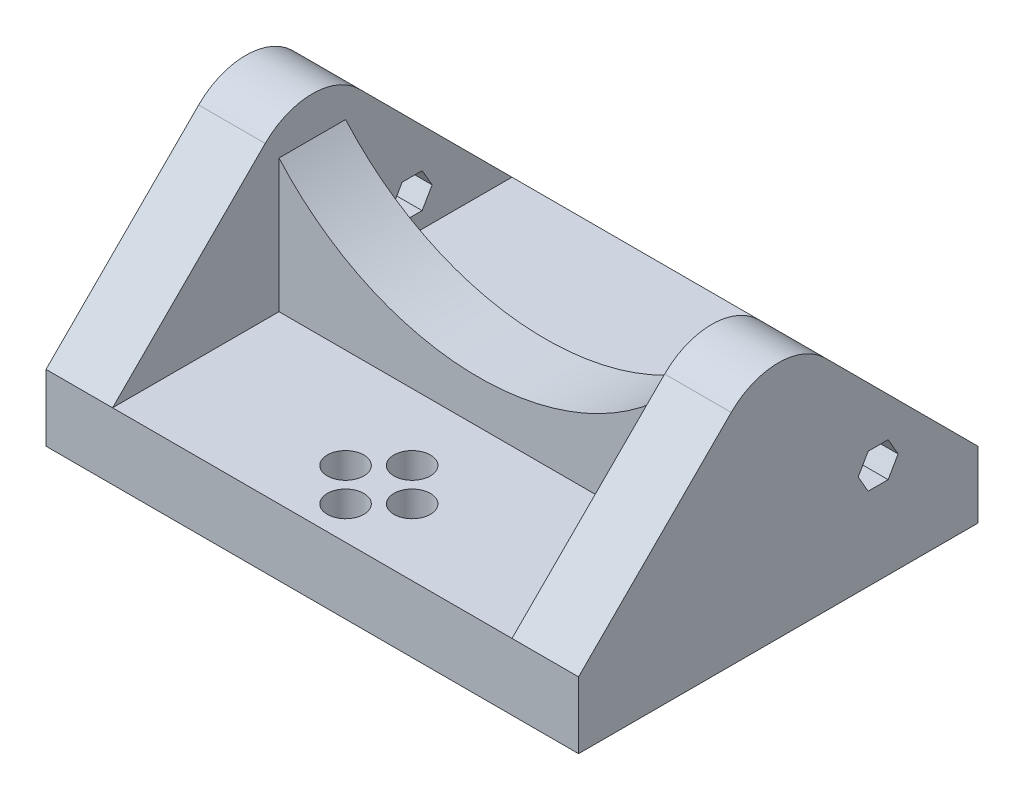
ISO-10303-21;
HEADER;
FILE_DESCRIPTION(('STEP AP214'),'2;1');
FILE_NAME('part.step','',(''),(''),'','','');
FILE_SCHEMA(('AUTOMOTIVE_DESIGN { 1 0 10303 214 1 1 1 1 }'));
ENDSEC;
DATA;
#1=APPLICATION_CONTEXT('core data for automotive mechanical design processes');
#2=APPLICATION_PROTOCOL_DEFINITION('international standard','automotive_design',2000,#1);
#3=PRODUCT_CONTEXT('',#1,'mechanical');
#4=PRODUCT('Part','Part','',(#3));
#5=PRODUCT_RELATED_PRODUCT_CATEGORY('part','',(#4));
#6=PRODUCT_DEFINITION_FORMATION('','',#4);
#7=PRODUCT_DEFINITION_CONTEXT('part definition',#1,'design');
#8=PRODUCT_DEFINITION('design','',#6,#7);
#9=PRODUCT_DEFINITION_SHAPE('','',#8);
#10=(LENGTH_UNIT() NAMED_UNIT(*) SI_UNIT(.MILLI.,.METRE.));
#11=(NAMED_UNIT(*) PLANE_ANGLE_UNIT() SI_UNIT($,.RADIAN.));
#12=(NAMED_UNIT(*) SI_UNIT($,.STERADIAN.) SOLID_ANGLE_UNIT());
#13=UNCERTAINTY_MEASURE_WITH_UNIT(LENGTH_MEASURE(1.E-05),#10,'distance_accuracy_value','');
#14=(GEOMETRIC_REPRESENTATION_CONTEXT(3) GLOBAL_UNCERTAINTY_ASSIGNED_CONTEXT((#13)) GLOBAL_UNIT_ASSIGNED_CONTEXT((#10,
#11,#12)) REPRESENTATION_CONTEXT('',''));
#15=CARTESIAN_POINT('',(0.,0.,0.));
#16=DIRECTION('',(0.,0.,1.));
#17=DIRECTION('',(1.,0.,0.));
#18=AXIS2_PLACEMENT_3D('',#15,#16,#17);
#19=CARTESIAN_POINT('',(80.0000000000001,10.,0.));
#20=DIRECTION('',(-1.,0.,0.));
#21=DIRECTION('',(0.,0.,1.));
#22=AXIS2_PLACEMENT_3D('',#19,#20,#21);
#23=PLANE('',#22);
#24=DIRECTION('',(0.,-0.707106781186544,-0.707106781186551));
#25=VECTOR('',#24,1.);
#26=CARTESIAN_POINT('',(80.,39.9999999999997,-30.));
#27=LINE('',#26,#25);
#28=CARTESIAN_POINT('',(80.,32.9289321881343,-37.0710678118654));
#29=VERTEX_POINT('',#28);
#30=CARTESIAN_POINT('',(80.0000000000001,10.,-60.));
#31=VERTEX_POINT('',#30);
#32=EDGE_CURVE('E388',#29,#31,#27,.T.);
#33=ORIENTED_EDGE('',*,*,#32,.F.);
#34=CARTESIAN_POINT('',(80.0000000000001,25.8578643762688,-30.));
#35=DIRECTION('',(-1.,0.,0.));
#36=DIRECTION('',(0.,0.,1.));
#37=AXIS2_PLACEMENT_3D('',#34,#35,#36);
#38=CIRCLE('',#37,10.);
#39=CARTESIAN_POINT('',(80.,32.9289321881343,-22.9289321881346));
#40=VERTEX_POINT('',#39);
#41=EDGE_CURVE('E481',#29,#40,#38,.F.);
#42=ORIENTED_EDGE('',*,*,#41,.T.);
#43=DIRECTION('',(0.,0.707106781186544,-0.707106781186551));
#44=VECTOR('',#43,1.);
#45=CARTESIAN_POINT('',(80.,10.,0.));
#46=LINE('',#45,#44);
#47=CARTESIAN_POINT('',(80.,10.,0.));
#48=VERTEX_POINT('',#47);
#49=EDGE_CURVE('E391',#48,#40,#46,.T.);
#50=ORIENTED_EDGE('',*,*,#49,.F.);
#51=DIRECTION('',(0.,-1.,0.));
#52=VECTOR('',#51,1.);
#53=CARTESIAN_POINT('',(80.0000000000001,10.,0.));
#54=LINE('',#53,#52);
#55=CARTESIAN_POINT('',(80.0000000000001,0.,0.));
#56=VERTEX_POINT('',#55);
#57=EDGE_CURVE('E467',#48,#56,#54,.T.);
#58=ORIENTED_EDGE('',*,*,#57,.T.);
#59=DIRECTION('',(0.,0.,-1.));
#60=VECTOR('',#59,1.);
#61=CARTESIAN_POINT('',(80.0000000000001,0.,0.));
#62=LINE('',#61,#60);
#63=CARTESIAN_POINT('',(80.0000000000001,0.,-60.));
#64=VERTEX_POINT('',#63);
#65=EDGE_CURVE('E447',#56,#64,#62,.T.);
#66=ORIENTED_EDGE('',*,*,#65,.T.);
#67=DIRECTION('',(0.,-1.,0.));
#68=VECTOR('',#67,1.);
#69=CARTESIAN_POINT('',(80.0000000000001,10.,-60.));
#70=LINE('',#69,#68);
#71=EDGE_CURVE('E464',#31,#64,#70,.T.);
#72=ORIENTED_EDGE('',*,*,#71,.F.);
#73=EDGE_LOOP('',(#33,#42,#50,#58,#66,#72));
#74=FACE_BOUND('',#73,.T.);
#75=DIRECTION('',(0.,0.,-1.));
#76=VECTOR('',#75,1.);
#77=CARTESIAN_POINT('',(80.0000000000001,12.4019237886467,-43.5));
#78=LINE('',#77,#76);
#79=CARTESIAN_POINT('',(80.0000000000001,12.4019237886467,-43.5));
#80=VERTEX_POINT('',#79);
#81=CARTESIAN_POINT('',(80.0000000000001,12.4019237886467,-46.5));
#82=VERTEX_POINT('',#81);
#83=EDGE_CURVE('E215',#80,#82,#78,.T.);
#84=ORIENTED_EDGE('',*,*,#83,.F.);
#85=DIRECTION('',(0.,-0.86602540378444,-0.499999999999998));
#86=VECTOR('',#85,1.);
#87=CARTESIAN_POINT('',(80.0000000000001,15.,-42.));
#88=LINE('',#87,#86);
#89=CARTESIAN_POINT('',(80.0000000000001,15.,-42.));
#90=VERTEX_POINT('',#89);
#91=EDGE_CURVE('E251',#90,#80,#88,.T.);
#92=ORIENTED_EDGE('',*,*,#91,.F.);
#93=DIRECTION('',(0.,-0.866025403784439,0.5));
#94=VECTOR('',#93,1.);
#95=CARTESIAN_POINT('',(80.0000000000001,17.5980762113533,-43.5));
#96=LINE('',#95,#94);
#97=CARTESIAN_POINT('',(80.0000000000001,17.5980762113533,-43.5));
#98=VERTEX_POINT('',#97);
#99=EDGE_CURVE('E248',#98,#90,#96,.T.);
#100=ORIENTED_EDGE('',*,*,#99,.F.);
#101=DIRECTION('',(0.,0.,1.));
#102=VECTOR('',#101,1.);
#103=CARTESIAN_POINT('',(80.0000000000001,17.5980762113533,-46.5));
#104=LINE('',#103,#102);
#105=CARTESIAN_POINT('',(80.0000000000001,17.5980762113533,-46.5));
#106=VERTEX_POINT('',#105);
#107=EDGE_CURVE('E243',#106,#98,#104,.T.);
#108=ORIENTED_EDGE('',*,*,#107,.F.);
#109=DIRECTION('',(0.,0.866025403784439,0.5));
#110=VECTOR('',#109,1.);
#111=CARTESIAN_POINT('',(80.0000000000001,15.,-48.));
#112=LINE('',#111,#110);
#113=CARTESIAN_POINT('',(80.0000000000001,15.,-48.));
#114=VERTEX_POINT('',#113);
#115=EDGE_CURVE('E239',#114,#106,#112,.T.);
#116=ORIENTED_EDGE('',*,*,#115,.F.);
#117=DIRECTION('',(0.,0.866025403784439,-0.499999999999998));
#118=VECTOR('',#117,1.);
#119=CARTESIAN_POINT('',(80.0000000000001,12.4019237886467,-46.5));
#120=LINE('',#119,#118);
#121=EDGE_CURVE('E225',#82,#114,#120,.T.);
#122=ORIENTED_EDGE('',*,*,#121,.F.);
#123=EDGE_LOOP('',(#84,#92,#100,#108,#116,#122));
#124=FACE_BOUND('',#123,.T.);
#125=ADVANCED_FACE('F39',(#74,#124),#23,.F.);
#126=CARTESIAN_POINT('',(0.,10.,0.));
#127=DIRECTION('',(-1.,0.,0.));
#128=DIRECTION('',(0.,0.,1.));
#129=AXIS2_PLACEMENT_3D('',#126,#127,#128);
#130=PLANE('',#129);
#131=DIRECTION('',(0.,0.707106781186544,-0.707106781186551));
#132=VECTOR('',#131,1.);
#133=CARTESIAN_POINT('',(0.,10.,0.));
#134=LINE('',#133,#132);
#135=CARTESIAN_POINT('',(0.,10.,0.));
#136=VERTEX_POINT('',#135);
#137=CARTESIAN_POINT('',(0.,32.9289321881343,-22.9289321881346));
#138=VERTEX_POINT('',#137);
#139=EDGE_CURVE('E418',#136,#138,#134,.T.);
#140=ORIENTED_EDGE('',*,*,#139,.T.);
#141=CARTESIAN_POINT('',(0.,25.8578643762688,-30.));
#142=DIRECTION('',(-1.,0.,0.));
#143=DIRECTION('',(0.,0.,1.));
#144=AXIS2_PLACEMENT_3D('',#141,#142,#143);
#145=CIRCLE('',#144,10.);
#146=CARTESIAN_POINT('',(0.,32.9289321881343,-37.0710678118654));
#147=VERTEX_POINT('',#146);
#148=EDGE_CURVE('E488',#138,#147,#145,.T.);
#149=ORIENTED_EDGE('',*,*,#148,.T.);
#150=DIRECTION('',(0.,-0.707106781186544,-0.707106781186551));
#151=VECTOR('',#150,1.);
#152=CARTESIAN_POINT('',(0.,39.9999999999997,-30.));
#153=LINE('',#152,#151);
#154=CARTESIAN_POINT('',(0.,10.,-60.));
#155=VERTEX_POINT('',#154);
#156=EDGE_CURVE('E410',#147,#155,#153,.T.);
#157=ORIENTED_EDGE('',*,*,#156,.T.);
#158=DIRECTION('',(0.,-1.,0.));
#159=VECTOR('',#158,1.);
#160=CARTESIAN_POINT('',(0.,10.,-60.0000000000001));
#161=LINE('',#160,#159);
#162=CARTESIAN_POINT('',(0.,0.,-60.0000000000001));
#163=VERTEX_POINT('',#162);
#164=EDGE_CURVE('E461',#155,#163,#161,.T.);
#165=ORIENTED_EDGE('',*,*,#164,.T.);
#166=DIRECTION('',(0.,0.,-1.));
#167=VECTOR('',#166,1.);
#168=CARTESIAN_POINT('',(0.,0.,0.));
#169=LINE('',#168,#167);
#170=CARTESIAN_POINT('',(0.,0.,0.));
#171=VERTEX_POINT('',#170);
#172=EDGE_CURVE('E455',#171,#163,#169,.T.);
#173=ORIENTED_EDGE('',*,*,#172,.F.);
#174=DIRECTION('',(0.,-1.,0.));
#175=VECTOR('',#174,1.);
#176=CARTESIAN_POINT('',(0.,10.,0.));
#177=LINE('',#176,#175);
#178=EDGE_CURVE('E443',#136,#171,#177,.T.);
#179=ORIENTED_EDGE('',*,*,#178,.F.);
#180=EDGE_LOOP('',(#140,#149,#157,#165,#173,#179));
#181=FACE_BOUND('',#180,.T.);
#182=DIRECTION('',(0.,-0.86602540378444,-0.499999999999998));
#183=VECTOR('',#182,1.);
#184=CARTESIAN_POINT('',(0.,15.,-42.));
#185=LINE('',#184,#183);
#186=CARTESIAN_POINT('',(0.,15.,-42.));
#187=VERTEX_POINT('',#186);
#188=CARTESIAN_POINT('',(0.,12.4019237886467,-43.5));
#189=VERTEX_POINT('',#188);
#190=EDGE_CURVE('E226',#187,#189,#185,.T.);
#191=ORIENTED_EDGE('',*,*,#190,.T.);
#192=DIRECTION('',(0.,0.,-1.));
#193=VECTOR('',#192,1.);
#194=CARTESIAN_POINT('',(0.,12.4019237886467,-43.5));
#195=LINE('',#194,#193);
#196=CARTESIAN_POINT('',(0.,12.4019237886467,-46.5));
#197=VERTEX_POINT('',#196);
#198=EDGE_CURVE('E63',#189,#197,#195,.T.);
#199=ORIENTED_EDGE('',*,*,#198,.T.);
#200=DIRECTION('',(0.,0.866025403784439,-0.499999999999998));
#201=VECTOR('',#200,1.);
#202=CARTESIAN_POINT('',(0.,12.4019237886467,-46.5));
#203=LINE('',#202,#201);
#204=CARTESIAN_POINT('',(0.,15.,-48.));
#205=VERTEX_POINT('',#204);
#206=EDGE_CURVE('E257',#197,#205,#203,.T.);
#207=ORIENTED_EDGE('',*,*,#206,.T.);
#208=DIRECTION('',(0.,0.866025403784439,0.5));
#209=VECTOR('',#208,1.);
#210=CARTESIAN_POINT('',(0.,15.,-48.));
#211=LINE('',#210,#209);
#212=CARTESIAN_POINT('',(0.,17.5980762113533,-46.5));
#213=VERTEX_POINT('',#212);
#214=EDGE_CURVE('E261',#205,#213,#211,.T.);
#215=ORIENTED_EDGE('',*,*,#214,.T.);
#216=DIRECTION('',(0.,0.,1.));
#217=VECTOR('',#216,1.);
#218=CARTESIAN_POINT('',(0.,17.5980762113533,-46.5));
#219=LINE('',#218,#217);
#220=CARTESIAN_POINT('',(0.,17.5980762113533,-43.5));
#221=VERTEX_POINT('',#220);
#222=EDGE_CURVE('E265',#213,#221,#219,.T.);
#223=ORIENTED_EDGE('',*,*,#222,.T.);
#224=DIRECTION('',(0.,-0.866025403784439,0.5));
#225=VECTOR('',#224,1.);
#226=CARTESIAN_POINT('',(0.,17.5980762113533,-43.5));
#227=LINE('',#226,#225);
#228=EDGE_CURVE('E269',#221,#187,#227,.T.);
#229=ORIENTED_EDGE('',*,*,#228,.T.);
#230=EDGE_LOOP('',(#191,#199,#207,#215,#223,#229));
#231=FACE_BOUND('',#230,.T.);
#232=ADVANCED_FACE('F525',(#181,#231),#130,.T.);
#233=CARTESIAN_POINT('',(10.,0.,0.));
#234=DIRECTION('',(1.,0.,0.));
#235=DIRECTION('',(0.,0.,-1.));
#236=AXIS2_PLACEMENT_3D('',#233,#234,#235);
#237=PLANE('',#236);
#238=DIRECTION('',(0.,-0.707106781186544,-0.707106781186551));
#239=VECTOR('',#238,1.);
#240=CARTESIAN_POINT('',(10.,39.9999999999997,-30.));
#241=LINE('',#240,#239);
#242=CARTESIAN_POINT('',(10.,32.9289321881343,-37.0710678118654));
#243=VERTEX_POINT('',#242);
#244=CARTESIAN_POINT('',(10.,10.,-60.));
#245=VERTEX_POINT('',#244);
#246=EDGE_CURVE('E414',#243,#245,#241,.T.);
#247=ORIENTED_EDGE('',*,*,#246,.F.);
#248=CARTESIAN_POINT('',(10.,25.8578643762688,-30.));
#249=DIRECTION('',(1.,0.,0.));
#250=DIRECTION('',(0.,0.,-1.));
#251=AXIS2_PLACEMENT_3D('',#248,#249,#250);
#252=CIRCLE('',#251,10.);
#253=CARTESIAN_POINT('',(10.,32.9289321881343,-22.9289321881346));
#254=VERTEX_POINT('',#253);
#255=EDGE_CURVE('E494',#243,#254,#252,.T.);
#256=ORIENTED_EDGE('',*,*,#255,.T.);
#257=DIRECTION('',(0.,0.707106781186544,-0.707106781186551));
#258=VECTOR('',#257,1.);
#259=CARTESIAN_POINT('',(10.,10.,0.));
#260=LINE('',#259,#258);
#261=CARTESIAN_POINT('',(10.,10.,0.));
#262=VERTEX_POINT('',#261);
#263=EDGE_CURVE('E423',#262,#254,#260,.T.);
#264=ORIENTED_EDGE('',*,*,#263,.F.);
#265=DIRECTION('',(0.,0.,1.));
#266=VECTOR('',#265,1.);
#267=CARTESIAN_POINT('',(10.,10.,-60.));
#268=LINE('',#267,#266);
#269=CARTESIAN_POINT('',(10.,10.,-25.));
#270=VERTEX_POINT('',#269);
#271=EDGE_CURVE('E417',#270,#262,#268,.T.);
#272=ORIENTED_EDGE('',*,*,#271,.F.);
#273=DIRECTION('',(0.,-1.,0.));
#274=VECTOR('',#273,1.);
#275=CARTESIAN_POINT('',(10.,30.,-25.));
#276=LINE('',#275,#274);
#277=CARTESIAN_POINT('',(10.,30.,-25.));
#278=VERTEX_POINT('',#277);
#279=EDGE_CURVE('E351',#278,#270,#276,.T.);
#280=ORIENTED_EDGE('',*,*,#279,.F.);
#281=DIRECTION('',(0.,0.,-1.));
#282=VECTOR('',#281,1.);
#283=CARTESIAN_POINT('',(9.99999999999999,30.,-25.));
#284=LINE('',#283,#282);
#285=CARTESIAN_POINT('',(10.,30.,-35.));
#286=VERTEX_POINT('',#285);
#287=EDGE_CURVE('E368',#278,#286,#284,.T.);
#288=ORIENTED_EDGE('',*,*,#287,.T.);
#289=DIRECTION('',(0.,-1.,0.));
#290=VECTOR('',#289,1.);
#291=CARTESIAN_POINT('',(10.,30.,-35.));
#292=LINE('',#291,#290);
#293=CARTESIAN_POINT('',(10.,10.,-35.));
#294=VERTEX_POINT('',#293);
#295=EDGE_CURVE('E347',#286,#294,#292,.T.);
#296=ORIENTED_EDGE('',*,*,#295,.T.);
#297=EDGE_CURVE('E419',#245,#294,#268,.T.);
#298=ORIENTED_EDGE('',*,*,#297,.F.);
#299=EDGE_LOOP('',(#247,#256,#264,#272,#280,#288,#296,#298));
#300=FACE_BOUND('',#299,.T.);
#301=DIRECTION('',(0.,-0.86602540378444,0.499999999999999));
#302=VECTOR('',#301,1.);
#303=CARTESIAN_POINT('',(10.,-17.0346096908265,-29.5048094716168));
#304=LINE('',#303,#302);
#305=CARTESIAN_POINT('',(9.99999999999999,15.,-48.));
#306=VERTEX_POINT('',#305);
#307=CARTESIAN_POINT('',(9.99999999999999,12.4019237886467,-46.5));
#308=VERTEX_POINT('',#307);
#309=EDGE_CURVE('E310',#306,#308,#304,.T.);
#310=ORIENTED_EDGE('',*,*,#309,.T.);
#311=DIRECTION('',(0.,0.,1.));
#312=VECTOR('',#311,1.);
#313=CARTESIAN_POINT('',(10.,12.4019237886467,0.));
#314=LINE('',#313,#312);
#315=CARTESIAN_POINT('',(9.99999999999999,12.4019237886467,-43.5));
#316=VERTEX_POINT('',#315);
#317=EDGE_CURVE('E314',#308,#316,#314,.T.);
#318=ORIENTED_EDGE('',*,*,#317,.T.);
#319=DIRECTION('',(0.,0.86602540378444,0.499999999999998));
#320=VECTOR('',#319,1.);
#321=CARTESIAN_POINT('',(10.,21.9365334794731,-37.9951905283833));
#322=LINE('',#321,#320);
#323=CARTESIAN_POINT('',(10.,15.,-42.));
#324=VERTEX_POINT('',#323);
#325=EDGE_CURVE('E234',#316,#324,#322,.T.);
#326=ORIENTED_EDGE('',*,*,#325,.T.);
#327=DIRECTION('',(0.,0.866025403784439,-0.5));
#328=VECTOR('',#327,1.);
#329=CARTESIAN_POINT('',(10.,-14.4365334794732,-25.0048094716167));
#330=LINE('',#329,#328);
#331=CARTESIAN_POINT('',(9.99999999999999,17.5980762113533,-43.5));
#332=VERTEX_POINT('',#331);
#333=EDGE_CURVE('E298',#324,#332,#330,.T.);
#334=ORIENTED_EDGE('',*,*,#333,.T.);
#335=DIRECTION('',(0.,0.,-1.));
#336=VECTOR('',#335,1.);
#337=CARTESIAN_POINT('',(10.,17.5980762113533,0.));
#338=LINE('',#337,#336);
#339=CARTESIAN_POINT('',(9.99999999999999,17.5980762113533,-46.5));
#340=VERTEX_POINT('',#339);
#341=EDGE_CURVE('E302',#332,#340,#338,.T.);
#342=ORIENTED_EDGE('',*,*,#341,.T.);
#343=DIRECTION('',(0.,-0.866025403784439,-0.5));
#344=VECTOR('',#343,1.);
#345=CARTESIAN_POINT('',(10.,24.5346096908265,-42.4951905283833));
#346=LINE('',#345,#344);
#347=EDGE_CURVE('E306',#340,#306,#346,.T.);
#348=ORIENTED_EDGE('',*,*,#347,.T.);
#349=EDGE_LOOP('',(#310,#318,#326,#334,#342,#348));
#350=FACE_BOUND('',#349,.T.);
#351=ADVANCED_FACE('F533',(#300,#350),#237,.T.);
#352=CARTESIAN_POINT('',(70.,0.,0.));
#353=DIRECTION('',(1.,0.,0.));
#354=DIRECTION('',(0.,0.,-1.));
#355=AXIS2_PLACEMENT_3D('',#352,#353,#354);
#356=PLANE('',#355);
#357=DIRECTION('',(0.,0.707106781186544,-0.707106781186551));
#358=VECTOR('',#357,1.);
#359=CARTESIAN_POINT('',(70.,10.,0.));
#360=LINE('',#359,#358);
#361=CARTESIAN_POINT('',(70.,10.,0.));
#362=VERTEX_POINT('',#361);
#363=CARTESIAN_POINT('',(70.,32.9289321881343,-22.9289321881346));
#364=VERTEX_POINT('',#363);
#365=EDGE_CURVE('E392',#362,#364,#360,.T.);
#366=ORIENTED_EDGE('',*,*,#365,.T.);
#367=CARTESIAN_POINT('',(70.,25.8578643762688,-30.));
#368=DIRECTION('',(1.,0.,0.));
#369=DIRECTION('',(0.,0.,-1.));
#370=AXIS2_PLACEMENT_3D('',#367,#368,#369);
#371=CIRCLE('',#370,10.);
#372=CARTESIAN_POINT('',(70.,32.9289321881343,-37.0710678118654));
#373=VERTEX_POINT('',#372);
#374=EDGE_CURVE('E475',#364,#373,#371,.F.);
#375=ORIENTED_EDGE('',*,*,#374,.T.);
#376=DIRECTION('',(0.,-0.707106781186544,-0.707106781186551));
#377=VECTOR('',#376,1.);
#378=CARTESIAN_POINT('',(70.,39.9999999999997,-30.));
#379=LINE('',#378,#377);
#380=CARTESIAN_POINT('',(70.,10.,-60.));
#381=VERTEX_POINT('',#380);
#382=EDGE_CURVE('E387',#373,#381,#379,.T.);
#383=ORIENTED_EDGE('',*,*,#382,.T.);
#384=DIRECTION('',(0.,0.,1.));
#385=VECTOR('',#384,1.);
#386=CARTESIAN_POINT('',(70.,10.,-60.));
#387=LINE('',#386,#385);
#388=CARTESIAN_POINT('',(70.,10.,-35.));
#389=VERTEX_POINT('',#388);
#390=EDGE_CURVE('E400',#381,#389,#387,.T.);
#391=ORIENTED_EDGE('',*,*,#390,.T.);
#392=DIRECTION('',(0.,1.,0.));
#393=VECTOR('',#392,1.);
#394=CARTESIAN_POINT('',(70.,10.,-35.));
#395=LINE('',#394,#393);
#396=CARTESIAN_POINT('',(70.,30.,-35.));
#397=VERTEX_POINT('',#396);
#398=EDGE_CURVE('E375',#389,#397,#395,.T.);
#399=ORIENTED_EDGE('',*,*,#398,.T.);
#400=DIRECTION('',(0.,0.,-1.));
#401=VECTOR('',#400,1.);
#402=CARTESIAN_POINT('',(70.,30.,-25.));
#403=LINE('',#402,#401);
#404=CARTESIAN_POINT('',(70.,30.,-25.));
#405=VERTEX_POINT('',#404);
#406=EDGE_CURVE('E383',#405,#397,#403,.T.);
#407=ORIENTED_EDGE('',*,*,#406,.F.);
#408=DIRECTION('',(0.,1.,0.));
#409=VECTOR('',#408,1.);
#410=CARTESIAN_POINT('',(70.,10.,-25.));
#411=LINE('',#410,#409);
#412=CARTESIAN_POINT('',(70.,10.,-25.));
#413=VERTEX_POINT('',#412);
#414=EDGE_CURVE('E360',#413,#405,#411,.T.);
#415=ORIENTED_EDGE('',*,*,#414,.F.);
#416=EDGE_CURVE('E399',#413,#362,#387,.T.);
#417=ORIENTED_EDGE('',*,*,#416,.T.);
#418=EDGE_LOOP('',(#366,#375,#383,#391,#399,#407,#415,#417));
#419=FACE_BOUND('',#418,.T.);
#420=DIRECTION('',(0.,0.,1.));
#421=VECTOR('',#420,1.);
#422=CARTESIAN_POINT('',(70.,12.4019237886467,0.));
#423=LINE('',#422,#421);
#424=CARTESIAN_POINT('',(70.,12.4019237886467,-46.5));
#425=VERTEX_POINT('',#424);
#426=CARTESIAN_POINT('',(70.,12.4019237886467,-43.5));
#427=VERTEX_POINT('',#426);
#428=EDGE_CURVE('E11',#425,#427,#423,.T.);
#429=ORIENTED_EDGE('',*,*,#428,.F.);
#430=DIRECTION('',(0.,-0.86602540378444,0.499999999999999));
#431=VECTOR('',#430,1.);
#432=CARTESIAN_POINT('',(70.,-17.0346096908265,-29.5048094716168));
#433=LINE('',#432,#431);
#434=CARTESIAN_POINT('',(70.,15.,-48.));
#435=VERTEX_POINT('',#434);
#436=EDGE_CURVE('E48',#435,#425,#433,.T.);
#437=ORIENTED_EDGE('',*,*,#436,.F.);
#438=DIRECTION('',(0.,-0.866025403784439,-0.5));
#439=VECTOR('',#438,1.);
#440=CARTESIAN_POINT('',(70.,24.5346096908265,-42.4951905283833));
#441=LINE('',#440,#439);
#442=CARTESIAN_POINT('',(70.,17.5980762113533,-46.5));
#443=VERTEX_POINT('',#442);
#444=EDGE_CURVE('E506',#443,#435,#441,.T.);
#445=ORIENTED_EDGE('',*,*,#444,.F.);
#446=DIRECTION('',(0.,0.,-1.));
#447=VECTOR('',#446,1.);
#448=CARTESIAN_POINT('',(70.,17.5980762113533,0.));
#449=LINE('',#448,#447);
#450=CARTESIAN_POINT('',(70.,17.5980762113533,-43.5));
#451=VERTEX_POINT('',#450);
#452=EDGE_CURVE('E503',#451,#443,#449,.T.);
#453=ORIENTED_EDGE('',*,*,#452,.F.);
#454=DIRECTION('',(0.,0.866025403784439,-0.5));
#455=VECTOR('',#454,1.);
#456=CARTESIAN_POINT('',(70.,-14.4365334794732,-25.0048094716167));
#457=LINE('',#456,#455);
#458=CARTESIAN_POINT('',(70.,15.,-42.));
#459=VERTEX_POINT('',#458);
#460=EDGE_CURVE('E500',#459,#451,#457,.T.);
#461=ORIENTED_EDGE('',*,*,#460,.F.);
#462=DIRECTION('',(0.,0.86602540378444,0.499999999999998));
#463=VECTOR('',#462,1.);
#464=CARTESIAN_POINT('',(70.,21.9365334794731,-37.9951905283833));
#465=LINE('',#464,#463);
#466=EDGE_CURVE('E497',#427,#459,#465,.T.);
#467=ORIENTED_EDGE('',*,*,#466,.F.);
#468=EDGE_LOOP('',(#429,#437,#445,#453,#461,#467));
#469=FACE_BOUND('',#468,.T.);
#470=ADVANCED_FACE('F630',(#419,#469),#356,.F.);
#471=CARTESIAN_POINT('',(0.,10.,0.));
#472=DIRECTION('',(0.,1.,0.));
#473=DIRECTION('',(0.,0.,1.));
#474=AXIS2_PLACEMENT_3D('',#471,#472,#473);
#475=PLANE('',#474);
#476=ORIENTED_EDGE('',*,*,#297,.T.);
#477=DIRECTION('',(1.,0.,0.));
#478=VECTOR('',#477,1.);
#479=CARTESIAN_POINT('',(10.,10.,-35.));
#480=LINE('',#479,#478);
#481=EDGE_CURVE('E371',#294,#389,#480,.T.);
#482=ORIENTED_EDGE('',*,*,#481,.T.);
#483=ORIENTED_EDGE('',*,*,#390,.F.);
#484=DIRECTION('',(1.,0.,0.));
#485=VECTOR('',#484,1.);
#486=CARTESIAN_POINT('',(0.,10.,-60.0000000000001));
#487=LINE('',#486,#485);
#488=EDGE_CURVE('E437',#245,#381,#487,.T.);
#489=ORIENTED_EDGE('',*,*,#488,.F.);
#490=EDGE_LOOP('',(#476,#482,#483,#489));
#491=FACE_BOUND('',#490,.T.);
#492=ADVANCED_FACE('F626',(#491),#475,.T.);
#493=CARTESIAN_POINT('',(40.0000000000001,10.,-5.));
#494=DIRECTION('',(0.,1.,0.));
#495=DIRECTION('',(0.,0.,1.));
#496=AXIS2_PLACEMENT_3D('',#493,#494,#495);
#497=CIRCLE('',#496,2.7392051131385);
#498=CARTESIAN_POINT('',(40.0000000000001,10.,-2.26079488686151));
#499=VERTEX_POINT('',#498);
#500=EDGE_CURVE('E323',#499,#499,#497,.T.);
#501=ORIENTED_EDGE('',*,*,#500,.F.);
#502=EDGE_LOOP('',(#501));
#503=FACE_BOUND('',#502,.T.);
#504=CARTESIAN_POINT('',(45.0000000000001,10.,-10.));
#505=DIRECTION('',(0.,1.,0.));
#506=DIRECTION('',(0.,0.,1.));
#507=AXIS2_PLACEMENT_3D('',#504,#505,#506);
#508=CIRCLE('',#507,2.73920511313849);
#509=CARTESIAN_POINT('',(45.0000000000001,10.,-7.26079488686155));
#510=VERTEX_POINT('',#509);
#511=EDGE_CURVE('E331',#510,#510,#508,.T.);
#512=ORIENTED_EDGE('',*,*,#511,.F.);
#513=EDGE_LOOP('',(#512));
#514=FACE_BOUND('',#513,.T.);
#515=CARTESIAN_POINT('',(35.0000000000001,10.,-9.99999999999999));
#516=DIRECTION('',(0.,1.,0.));
#517=DIRECTION('',(0.,0.,1.));
#518=AXIS2_PLACEMENT_3D('',#515,#516,#517);
#519=CIRCLE('',#518,2.73920511313849);
#520=CARTESIAN_POINT('',(35.0000000000001,10.,-7.2607948868615));
#521=VERTEX_POINT('',#520);
#522=EDGE_CURVE('E318',#521,#521,#519,.T.);
#523=ORIENTED_EDGE('',*,*,#522,.F.);
#524=EDGE_LOOP('',(#523));
#525=FACE_BOUND('',#524,.T.);
#526=CARTESIAN_POINT('',(40.,10.,-15.));
#527=DIRECTION('',(0.,1.,0.));
#528=DIRECTION('',(0.,0.,1.));
#529=AXIS2_PLACEMENT_3D('',#526,#527,#528);
#530=CIRCLE('',#529,2.7392051131385);
#531=CARTESIAN_POINT('',(40.,10.,-12.2607948868615));
#532=VERTEX_POINT('',#531);
#533=EDGE_CURVE('E339',#532,#532,#530,.T.);
#534=ORIENTED_EDGE('',*,*,#533,.F.);
#535=EDGE_LOOP('',(#534));
#536=FACE_BOUND('',#535,.T.);
#537=DIRECTION('',(1.,0.,0.));
#538=VECTOR('',#537,1.);
#539=CARTESIAN_POINT('',(10.,10.,-25.));
#540=LINE('',#539,#538);
#541=EDGE_CURVE('E355',#270,#413,#540,.T.);
#542=ORIENTED_EDGE('',*,*,#541,.F.);
#543=ORIENTED_EDGE('',*,*,#271,.T.);
#544=DIRECTION('',(1.,0.,0.));
#545=VECTOR('',#544,1.);
#546=CARTESIAN_POINT('',(0.,10.,0.));
#547=LINE('',#546,#545);
#548=EDGE_CURVE('E438',#262,#362,#547,.T.);
#549=ORIENTED_EDGE('',*,*,#548,.T.);
#550=ORIENTED_EDGE('',*,*,#416,.F.);
#551=EDGE_LOOP('',(#542,#543,#549,#550));
#552=FACE_BOUND('',#551,.T.);
#553=ADVANCED_FACE('F573',(#503,#514,#525,#536,#552),#475,.T.);
#554=CARTESIAN_POINT('',(0.,10.,0.));
#555=DIRECTION('',(0.,0.,-1.));
#556=DIRECTION('',(-1.,0.,0.));
#557=AXIS2_PLACEMENT_3D('',#554,#555,#556);
#558=PLANE('',#557);
#559=DIRECTION('',(1.,0.,0.));
#560=VECTOR('',#559,1.);
#561=CARTESIAN_POINT('',(0.,0.,0.));
#562=LINE('',#561,#560);
#563=EDGE_CURVE('E427',#171,#56,#562,.T.);
#564=ORIENTED_EDGE('',*,*,#563,.T.);
#565=ORIENTED_EDGE('',*,*,#57,.F.);
#566=DIRECTION('',(-1.,0.,0.));
#567=VECTOR('',#566,1.);
#568=CARTESIAN_POINT('',(80.,10.,0.));
#569=LINE('',#568,#567);
#570=EDGE_CURVE('E406',#48,#362,#569,.T.);
#571=ORIENTED_EDGE('',*,*,#570,.T.);
#572=ORIENTED_EDGE('',*,*,#548,.F.);
#573=EDGE_CURVE('E433',#136,#262,#547,.T.);
#574=ORIENTED_EDGE('',*,*,#573,.F.);
#575=ORIENTED_EDGE('',*,*,#178,.T.);
#576=EDGE_LOOP('',(#564,#565,#571,#572,#574,#575));
#577=FACE_BOUND('',#576,.T.);
#578=ADVANCED_FACE('F571',(#577),#558,.F.);
#579=CARTESIAN_POINT('',(0.,10.,-60.0000000000001));
#580=DIRECTION('',(0.,0.,-1.));
#581=DIRECTION('',(-1.,0.,0.));
#582=AXIS2_PLACEMENT_3D('',#579,#580,#581);
#583=PLANE('',#582);
#584=DIRECTION('',(1.,0.,0.));
#585=VECTOR('',#584,1.);
#586=CARTESIAN_POINT('',(0.,0.,-60.0000000000001));
#587=LINE('',#586,#585);
#588=EDGE_CURVE('E451',#163,#64,#587,.T.);
#589=ORIENTED_EDGE('',*,*,#588,.F.);
#590=ORIENTED_EDGE('',*,*,#164,.F.);
#591=EDGE_CURVE('E439',#155,#245,#487,.T.);
#592=ORIENTED_EDGE('',*,*,#591,.T.);
#593=ORIENTED_EDGE('',*,*,#488,.T.);
#594=DIRECTION('',(-1.,0.,0.));
#595=VECTOR('',#594,1.);
#596=CARTESIAN_POINT('',(80.,10.,-60.));
#597=LINE('',#596,#595);
#598=EDGE_CURVE('E396',#31,#381,#597,.T.);
#599=ORIENTED_EDGE('',*,*,#598,.F.);
#600=ORIENTED_EDGE('',*,*,#71,.T.);
#601=EDGE_LOOP('',(#589,#590,#592,#593,#599,#600));
#602=FACE_BOUND('',#601,.T.);
#603=ADVANCED_FACE('F570',(#602),#583,.T.);
#604=CARTESIAN_POINT('',(0.,0.,0.));
#605=DIRECTION('',(0.,1.,0.));
#606=DIRECTION('',(0.,0.,1.));
#607=AXIS2_PLACEMENT_3D('',#604,#605,#606);
#608=PLANE('',#607);
#609=CARTESIAN_POINT('',(40.0000000000001,0.,-5.));
#610=DIRECTION('',(0.,1.,0.));
#611=DIRECTION('',(0.,0.,1.));
#612=AXIS2_PLACEMENT_3D('',#609,#610,#611);
#613=CIRCLE('',#612,2.7392051131385);
#614=CARTESIAN_POINT('',(40.0000000000001,0.,-2.26079488686151));
#615=VERTEX_POINT('',#614);
#616=EDGE_CURVE('E327',#615,#615,#613,.T.);
#617=ORIENTED_EDGE('',*,*,#616,.T.);
#618=EDGE_LOOP('',(#617));
#619=FACE_BOUND('',#618,.T.);
#620=CARTESIAN_POINT('',(45.0000000000001,0.,-10.));
#621=DIRECTION('',(0.,1.,0.));
#622=DIRECTION('',(0.,0.,1.));
#623=AXIS2_PLACEMENT_3D('',#620,#621,#622);
#624=CIRCLE('',#623,2.73920511313849);
#625=CARTESIAN_POINT('',(45.0000000000001,0.,-7.26079488686155));
#626=VERTEX_POINT('',#625);
#627=EDGE_CURVE('E335',#626,#626,#624,.T.);
#628=ORIENTED_EDGE('',*,*,#627,.T.);
#629=EDGE_LOOP('',(#628));
#630=FACE_BOUND('',#629,.T.);
#631=CARTESIAN_POINT('',(35.0000000000001,0.,-9.99999999999999));
#632=DIRECTION('',(0.,1.,0.));
#633=DIRECTION('',(0.,0.,1.));
#634=AXIS2_PLACEMENT_3D('',#631,#632,#633);
#635=CIRCLE('',#634,2.73920511313849);
#636=CARTESIAN_POINT('',(35.0000000000001,0.,-7.2607948868615));
#637=VERTEX_POINT('',#636);
#638=EDGE_CURVE('E319',#637,#637,#635,.T.);
#639=ORIENTED_EDGE('',*,*,#638,.T.);
#640=EDGE_LOOP('',(#639));
#641=FACE_BOUND('',#640,.T.);
#642=CARTESIAN_POINT('',(40.,0.,-15.));
#643=DIRECTION('',(0.,1.,0.));
#644=DIRECTION('',(0.,0.,1.));
#645=AXIS2_PLACEMENT_3D('',#642,#643,#644);
#646=CIRCLE('',#645,2.7392051131385);
#647=CARTESIAN_POINT('',(40.,0.,-12.2607948868615));
#648=VERTEX_POINT('',#647);
#649=EDGE_CURVE('E343',#648,#648,#646,.T.);
#650=ORIENTED_EDGE('',*,*,#649,.T.);
#651=EDGE_LOOP('',(#650));
#652=FACE_BOUND('',#651,.T.);
#653=ORIENTED_EDGE('',*,*,#563,.F.);
#654=ORIENTED_EDGE('',*,*,#172,.T.);
#655=ORIENTED_EDGE('',*,*,#588,.T.);
#656=ORIENTED_EDGE('',*,*,#65,.F.);
#657=EDGE_LOOP('',(#653,#654,#655,#656));
#658=FACE_BOUND('',#657,.T.);
#659=ADVANCED_FACE('F613',(#619,#630,#641,#652,#658),#608,.F.);
#660=CARTESIAN_POINT('',(10.,39.9999999999997,-30.));
#661=DIRECTION('',(0.,0.707106781186551,-0.707106781186544));
#662=DIRECTION('',(0.,0.707106781186544,0.707106781186551));
#663=AXIS2_PLACEMENT_3D('',#660,#661,#662);
#664=PLANE('',#663);
#665=ORIENTED_EDGE('',*,*,#156,.F.);
#666=DIRECTION('',(-1.,0.,0.));
#667=VECTOR('',#666,1.);
#668=CARTESIAN_POINT('',(10.,32.9289321881343,-37.0710678118654));
#669=LINE('',#668,#667);
#670=EDGE_CURVE('E491',#147,#243,#669,.F.);
#671=ORIENTED_EDGE('',*,*,#670,.T.);
#672=ORIENTED_EDGE('',*,*,#246,.T.);
#673=ORIENTED_EDGE('',*,*,#591,.F.);
#674=EDGE_LOOP('',(#665,#671,#672,#673));
#675=FACE_BOUND('',#674,.T.);
#676=ADVANCED_FACE('F642',(#675),#664,.T.);
#677=CARTESIAN_POINT('',(10.,10.,0.));
#678=DIRECTION('',(0.,0.707106781186551,0.707106781186544));
#679=DIRECTION('',(0.,-0.707106781186544,0.707106781186551));
#680=AXIS2_PLACEMENT_3D('',#677,#678,#679);
#681=PLANE('',#680);
#682=ORIENTED_EDGE('',*,*,#263,.T.);
#683=DIRECTION('',(-1.,0.,0.));
#684=VECTOR('',#683,1.);
#685=CARTESIAN_POINT('',(10.,32.9289321881343,-22.9289321881346));
#686=LINE('',#685,#684);
#687=EDGE_CURVE('E484',#254,#138,#686,.T.);
#688=ORIENTED_EDGE('',*,*,#687,.T.);
#689=ORIENTED_EDGE('',*,*,#139,.F.);
#690=ORIENTED_EDGE('',*,*,#573,.T.);
#691=EDGE_LOOP('',(#682,#688,#689,#690));
#692=FACE_BOUND('',#691,.T.);
#693=ADVANCED_FACE('F608',(#692),#681,.T.);
#694=CARTESIAN_POINT('',(80.,39.9999999999997,-30.));
#695=DIRECTION('',(0.,0.707106781186551,-0.707106781186544));
#696=DIRECTION('',(0.,0.707106781186544,0.707106781186551));
#697=AXIS2_PLACEMENT_3D('',#694,#695,#696);
#698=PLANE('',#697);
#699=ORIENTED_EDGE('',*,*,#382,.F.);
#700=DIRECTION('',(-1.,0.,0.));
#701=VECTOR('',#700,1.);
#702=CARTESIAN_POINT('',(80.,32.9289321881343,-37.0710678118654));
#703=LINE('',#702,#701);
#704=EDGE_CURVE('E478',#373,#29,#703,.F.);
#705=ORIENTED_EDGE('',*,*,#704,.T.);
#706=ORIENTED_EDGE('',*,*,#32,.T.);
#707=ORIENTED_EDGE('',*,*,#598,.T.);
#708=EDGE_LOOP('',(#699,#705,#706,#707));
#709=FACE_BOUND('',#708,.T.);
#710=ADVANCED_FACE('F624',(#709),#698,.T.);
#711=CARTESIAN_POINT('',(80.,10.,0.));
#712=DIRECTION('',(0.,0.707106781186551,0.707106781186544));
#713=DIRECTION('',(0.,-0.707106781186544,0.707106781186551));
#714=AXIS2_PLACEMENT_3D('',#711,#712,#713);
#715=PLANE('',#714);
#716=ORIENTED_EDGE('',*,*,#49,.T.);
#717=DIRECTION('',(-1.,0.,0.));
#718=VECTOR('',#717,1.);
#719=CARTESIAN_POINT('',(80.,32.9289321881343,-22.9289321881346));
#720=LINE('',#719,#718);
#721=EDGE_CURVE('E471',#40,#364,#720,.T.);
#722=ORIENTED_EDGE('',*,*,#721,.T.);
#723=ORIENTED_EDGE('',*,*,#365,.F.);
#724=ORIENTED_EDGE('',*,*,#570,.F.);
#725=EDGE_LOOP('',(#716,#722,#723,#724));
#726=FACE_BOUND('',#725,.T.);
#727=ADVANCED_FACE('F595',(#726),#715,.T.);
#728=CARTESIAN_POINT('',(40.,56.4575131106459,-25.));
#729=DIRECTION('',(0.,0.,-1.));
#730=DIRECTION('',(-1.,0.,0.));
#731=AXIS2_PLACEMENT_3D('',#728,#729,#730);
#732=CYLINDRICAL_SURFACE('',#731,40.);
#733=CARTESIAN_POINT('',(40.,56.4575131106459,-35.));
#734=DIRECTION('',(0.,0.,1.));
#735=DIRECTION('',(1.,0.,0.));
#736=AXIS2_PLACEMENT_3D('',#733,#734,#735);
#737=CIRCLE('',#736,40.);
#738=EDGE_CURVE('E356',#286,#397,#737,.T.);
#739=ORIENTED_EDGE('',*,*,#738,.F.);
#740=ORIENTED_EDGE('',*,*,#287,.F.);
#741=CARTESIAN_POINT('',(40.,56.4575131106459,-25.));
#742=DIRECTION('',(0.,0.,1.));
#743=DIRECTION('',(1.,0.,0.));
#744=AXIS2_PLACEMENT_3D('',#741,#742,#743);
#745=CIRCLE('',#744,40.);
#746=EDGE_CURVE('E364',#278,#405,#745,.T.);
#747=ORIENTED_EDGE('',*,*,#746,.T.);
#748=ORIENTED_EDGE('',*,*,#406,.T.);
#749=EDGE_LOOP('',(#739,#740,#747,#748));
#750=FACE_BOUND('',#749,.T.);
#751=ADVANCED_FACE('F637',(#750),#732,.F.);
#752=CARTESIAN_POINT('',(40.,56.4575131106459,-25.));
#753=DIRECTION('',(0.,0.,1.));
#754=DIRECTION('',(1.,0.,0.));
#755=AXIS2_PLACEMENT_3D('',#752,#753,#754);
#756=PLANE('',#755);
#757=ORIENTED_EDGE('',*,*,#279,.T.);
#758=ORIENTED_EDGE('',*,*,#541,.T.);
#759=ORIENTED_EDGE('',*,*,#414,.T.);
#760=ORIENTED_EDGE('',*,*,#746,.F.);
#761=EDGE_LOOP('',(#757,#758,#759,#760));
#762=FACE_BOUND('',#761,.T.);
#763=ADVANCED_FACE('F585',(#762),#756,.T.);
#764=CARTESIAN_POINT('',(40.,56.4575131106459,-35.));
#765=DIRECTION('',(0.,0.,1.));
#766=DIRECTION('',(1.,0.,0.));
#767=AXIS2_PLACEMENT_3D('',#764,#765,#766);
#768=PLANE('',#767);
#769=ORIENTED_EDGE('',*,*,#295,.F.);
#770=ORIENTED_EDGE('',*,*,#738,.T.);
#771=ORIENTED_EDGE('',*,*,#398,.F.);
#772=ORIENTED_EDGE('',*,*,#481,.F.);
#773=EDGE_LOOP('',(#769,#770,#771,#772));
#774=FACE_BOUND('',#773,.T.);
#775=ADVANCED_FACE('F577',(#774),#768,.F.);
#776=CARTESIAN_POINT('',(80.,25.8578643762688,-30.));
#777=DIRECTION('',(-1.,0.,0.));
#778=DIRECTION('',(0.,0.,1.));
#779=AXIS2_PLACEMENT_3D('',#776,#777,#778);
#780=CYLINDRICAL_SURFACE('',#779,10.);
#781=ORIENTED_EDGE('',*,*,#41,.F.);
#782=ORIENTED_EDGE('',*,*,#704,.F.);
#783=ORIENTED_EDGE('',*,*,#374,.F.);
#784=ORIENTED_EDGE('',*,*,#721,.F.);
#785=EDGE_LOOP('',(#781,#782,#783,#784));
#786=FACE_BOUND('',#785,.T.);
#787=ADVANCED_FACE('F575',(#786),#780,.T.);
#788=CARTESIAN_POINT('',(10.,25.8578643762688,-30.));
#789=DIRECTION('',(-1.,0.,0.));
#790=DIRECTION('',(0.,0.,1.));
#791=AXIS2_PLACEMENT_3D('',#788,#789,#790);
#792=CYLINDRICAL_SURFACE('',#791,10.);
#793=ORIENTED_EDGE('',*,*,#255,.F.);
#794=ORIENTED_EDGE('',*,*,#670,.F.);
#795=ORIENTED_EDGE('',*,*,#148,.F.);
#796=ORIENTED_EDGE('',*,*,#687,.F.);
#797=EDGE_LOOP('',(#793,#794,#795,#796));
#798=FACE_BOUND('',#797,.T.);
#799=ADVANCED_FACE('F41',(#798),#792,.T.);
#800=CARTESIAN_POINT('',(40.,0.,-15.));
#801=DIRECTION('',(0.,1.,0.));
#802=DIRECTION('',(0.,0.,1.));
#803=AXIS2_PLACEMENT_3D('',#800,#801,#802);
#804=CYLINDRICAL_SURFACE('',#803,2.7392051131385);
#805=ORIENTED_EDGE('',*,*,#649,.F.);
#806=EDGE_LOOP('',(#805));
#807=FACE_BOUND('',#806,.T.);
#808=ORIENTED_EDGE('',*,*,#533,.T.);
#809=EDGE_LOOP('',(#808));
#810=FACE_BOUND('',#809,.T.);
#811=ADVANCED_FACE('F583',(#807,#810),#804,.F.);
#812=CARTESIAN_POINT('',(35.0000000000001,0.,-9.99999999999999));
#813=DIRECTION('',(0.,1.,0.));
#814=DIRECTION('',(0.,0.,1.));
#815=AXIS2_PLACEMENT_3D('',#812,#813,#814);
#816=CYLINDRICAL_SURFACE('',#815,2.73920511313849);
#817=ORIENTED_EDGE('',*,*,#638,.F.);
#818=EDGE_LOOP('',(#817));
#819=FACE_BOUND('',#818,.T.);
#820=ORIENTED_EDGE('',*,*,#522,.T.);
#821=EDGE_LOOP('',(#820));
#822=FACE_BOUND('',#821,.T.);
#823=ADVANCED_FACE('F668',(#819,#822),#816,.F.);
#824=CARTESIAN_POINT('',(45.0000000000001,0.,-10.));
#825=DIRECTION('',(0.,1.,0.));
#826=DIRECTION('',(0.,0.,1.));
#827=AXIS2_PLACEMENT_3D('',#824,#825,#826);
#828=CYLINDRICAL_SURFACE('',#827,2.73920511313849);
#829=ORIENTED_EDGE('',*,*,#627,.F.);
#830=EDGE_LOOP('',(#829));
#831=FACE_BOUND('',#830,.T.);
#832=ORIENTED_EDGE('',*,*,#511,.T.);
#833=EDGE_LOOP('',(#832));
#834=FACE_BOUND('',#833,.T.);
#835=ADVANCED_FACE('F674',(#831,#834),#828,.F.);
#836=CARTESIAN_POINT('',(40.0000000000001,0.,-5.));
#837=DIRECTION('',(0.,1.,0.));
#838=DIRECTION('',(0.,0.,1.));
#839=AXIS2_PLACEMENT_3D('',#836,#837,#838);
#840=CYLINDRICAL_SURFACE('',#839,2.7392051131385);
#841=ORIENTED_EDGE('',*,*,#616,.F.);
#842=EDGE_LOOP('',(#841));
#843=FACE_BOUND('',#842,.T.);
#844=ORIENTED_EDGE('',*,*,#500,.T.);
#845=EDGE_LOOP('',(#844));
#846=FACE_BOUND('',#845,.T.);
#847=ADVANCED_FACE('F788',(#843,#846),#840,.F.);
#848=CARTESIAN_POINT('',(80.0000000000001,15.,-42.));
#849=DIRECTION('',(0.,0.499999999999998,-0.86602540378444));
#850=DIRECTION('',(0.,0.86602540378444,0.499999999999998));
#851=AXIS2_PLACEMENT_3D('',#848,#849,#850);
#852=PLANE('',#851);
#853=ORIENTED_EDGE('',*,*,#466,.T.);
#854=DIRECTION('',(-1.,0.,0.));
#855=VECTOR('',#854,1.);
#856=CARTESIAN_POINT('',(80.0000000000001,15.,-42.));
#857=LINE('',#856,#855);
#858=EDGE_CURVE('E55',#90,#459,#857,.T.);
#859=ORIENTED_EDGE('',*,*,#858,.F.);
#860=ORIENTED_EDGE('',*,*,#91,.T.);
#861=DIRECTION('',(-1.,0.,0.));
#862=VECTOR('',#861,1.);
#863=CARTESIAN_POINT('',(80.0000000000001,12.4019237886467,-43.5));
#864=LINE('',#863,#862);
#865=EDGE_CURVE('E220',#80,#427,#864,.T.);
#866=ORIENTED_EDGE('',*,*,#865,.T.);
#867=EDGE_LOOP('',(#853,#859,#860,#866));
#868=FACE_BOUND('',#867,.T.);
#869=ADVANCED_FACE('F796',(#868),#852,.T.);
#870=CARTESIAN_POINT('',(80.0000000000001,17.5980762113533,-43.5));
#871=DIRECTION('',(0.,-0.5,-0.866025403784439));
#872=DIRECTION('',(0.,0.866025403784439,-0.5));
#873=AXIS2_PLACEMENT_3D('',#870,#871,#872);
#874=PLANE('',#873);
#875=ORIENTED_EDGE('',*,*,#460,.T.);
#876=DIRECTION('',(-1.,0.,0.));
#877=VECTOR('',#876,1.);
#878=CARTESIAN_POINT('',(80.0000000000001,17.5980762113533,-43.5));
#879=LINE('',#878,#877);
#880=EDGE_CURVE('E282',#98,#451,#879,.T.);
#881=ORIENTED_EDGE('',*,*,#880,.F.);
#882=ORIENTED_EDGE('',*,*,#99,.T.);
#883=ORIENTED_EDGE('',*,*,#858,.T.);
#884=EDGE_LOOP('',(#875,#881,#882,#883));
#885=FACE_BOUND('',#884,.T.);
#886=ADVANCED_FACE('F554',(#885),#874,.T.);
#887=CARTESIAN_POINT('',(80.0000000000001,17.5980762113533,-46.5));
#888=DIRECTION('',(0.,-1.,0.));
#889=DIRECTION('',(0.,0.,-1.));
#890=AXIS2_PLACEMENT_3D('',#887,#888,#889);
#891=PLANE('',#890);
#892=ORIENTED_EDGE('',*,*,#452,.T.);
#893=DIRECTION('',(-1.,0.,0.));
#894=VECTOR('',#893,1.);
#895=CARTESIAN_POINT('',(80.0000000000001,17.5980762113533,-46.5));
#896=LINE('',#895,#894);
#897=EDGE_CURVE('E287',#106,#443,#896,.T.);
#898=ORIENTED_EDGE('',*,*,#897,.F.);
#899=ORIENTED_EDGE('',*,*,#107,.T.);
#900=ORIENTED_EDGE('',*,*,#880,.T.);
#901=EDGE_LOOP('',(#892,#898,#899,#900));
#902=FACE_BOUND('',#901,.T.);
#903=ADVANCED_FACE('F548',(#902),#891,.T.);
#904=CARTESIAN_POINT('',(80.0000000000001,15.,-48.));
#905=DIRECTION('',(0.,-0.5,0.866025403784439));
#906=DIRECTION('',(0.,-0.866025403784439,-0.5));
#907=AXIS2_PLACEMENT_3D('',#904,#905,#906);
#908=PLANE('',#907);
#909=ORIENTED_EDGE('',*,*,#444,.T.);
#910=DIRECTION('',(-1.,0.,0.));
#911=VECTOR('',#910,1.);
#912=CARTESIAN_POINT('',(80.0000000000001,15.,-48.));
#913=LINE('',#912,#911);
#914=EDGE_CURVE('E292',#114,#435,#913,.T.);
#915=ORIENTED_EDGE('',*,*,#914,.F.);
#916=ORIENTED_EDGE('',*,*,#115,.T.);
#917=ORIENTED_EDGE('',*,*,#897,.T.);
#918=EDGE_LOOP('',(#909,#915,#916,#917));
#919=FACE_BOUND('',#918,.T.);
#920=ADVANCED_FACE('F556',(#919),#908,.T.);
#921=CARTESIAN_POINT('',(80.0000000000001,12.4019237886467,-46.5));
#922=DIRECTION('',(0.,0.499999999999998,0.866025403784439));
#923=DIRECTION('',(0.,-0.86602540378444,0.499999999999999));
#924=AXIS2_PLACEMENT_3D('',#921,#922,#923);
#925=PLANE('',#924);
#926=ORIENTED_EDGE('',*,*,#436,.T.);
#927=DIRECTION('',(-1.,0.,0.));
#928=VECTOR('',#927,1.);
#929=CARTESIAN_POINT('',(80.0000000000001,12.4019237886467,-46.5));
#930=LINE('',#929,#928);
#931=EDGE_CURVE('E218',#82,#425,#930,.T.);
#932=ORIENTED_EDGE('',*,*,#931,.F.);
#933=ORIENTED_EDGE('',*,*,#121,.T.);
#934=ORIENTED_EDGE('',*,*,#914,.T.);
#935=EDGE_LOOP('',(#926,#932,#933,#934));
#936=FACE_BOUND('',#935,.T.);
#937=ADVANCED_FACE('F229',(#936),#925,.T.);
#938=CARTESIAN_POINT('',(80.0000000000001,12.4019237886467,-43.5));
#939=DIRECTION('',(0.,1.,0.));
#940=DIRECTION('',(0.,0.,1.));
#941=AXIS2_PLACEMENT_3D('',#938,#939,#940);
#942=PLANE('',#941);
#943=ORIENTED_EDGE('',*,*,#428,.T.);
#944=ORIENTED_EDGE('',*,*,#865,.F.);
#945=ORIENTED_EDGE('',*,*,#83,.T.);
#946=ORIENTED_EDGE('',*,*,#931,.T.);
#947=EDGE_LOOP('',(#943,#944,#945,#946));
#948=FACE_BOUND('',#947,.T.);
#949=ADVANCED_FACE('F217',(#948),#942,.T.);
#950=EDGE_CURVE('E235',#308,#197,#930,.T.);
#951=ORIENTED_EDGE('',*,*,#950,.T.);
#952=ORIENTED_EDGE('',*,*,#198,.F.);
#953=EDGE_CURVE('E254',#316,#189,#864,.T.);
#954=ORIENTED_EDGE('',*,*,#953,.F.);
#955=ORIENTED_EDGE('',*,*,#317,.F.);
#956=EDGE_LOOP('',(#951,#952,#954,#955));
#957=FACE_BOUND('',#956,.T.);
#958=ADVANCED_FACE('F535',(#957),#942,.T.);
#959=EDGE_CURVE('E291',#306,#205,#913,.T.);
#960=ORIENTED_EDGE('',*,*,#959,.T.);
#961=ORIENTED_EDGE('',*,*,#206,.F.);
#962=ORIENTED_EDGE('',*,*,#950,.F.);
#963=ORIENTED_EDGE('',*,*,#309,.F.);
#964=EDGE_LOOP('',(#960,#961,#962,#963));
#965=FACE_BOUND('',#964,.T.);
#966=ADVANCED_FACE('F538',(#965),#925,.T.);
#967=EDGE_CURVE('E286',#340,#213,#896,.T.);
#968=ORIENTED_EDGE('',*,*,#967,.T.);
#969=ORIENTED_EDGE('',*,*,#214,.F.);
#970=ORIENTED_EDGE('',*,*,#959,.F.);
#971=ORIENTED_EDGE('',*,*,#347,.F.);
#972=EDGE_LOOP('',(#968,#969,#970,#971));
#973=FACE_BOUND('',#972,.T.);
#974=ADVANCED_FACE('F542',(#973),#908,.T.);
#975=EDGE_CURVE('E281',#332,#221,#879,.T.);
#976=ORIENTED_EDGE('',*,*,#975,.T.);
#977=ORIENTED_EDGE('',*,*,#222,.F.);
#978=ORIENTED_EDGE('',*,*,#967,.F.);
#979=ORIENTED_EDGE('',*,*,#341,.F.);
#980=EDGE_LOOP('',(#976,#977,#978,#979));
#981=FACE_BOUND('',#980,.T.);
#982=ADVANCED_FACE('F545',(#981),#891,.T.);
#983=EDGE_CURVE('E278',#324,#187,#857,.T.);
#984=ORIENTED_EDGE('',*,*,#983,.T.);
#985=ORIENTED_EDGE('',*,*,#228,.F.);
#986=ORIENTED_EDGE('',*,*,#975,.F.);
#987=ORIENTED_EDGE('',*,*,#333,.F.);
#988=EDGE_LOOP('',(#984,#985,#986,#987));
#989=FACE_BOUND('',#988,.T.);
#990=ADVANCED_FACE('F530',(#989),#874,.T.);
#991=ORIENTED_EDGE('',*,*,#953,.T.);
#992=ORIENTED_EDGE('',*,*,#190,.F.);
#993=ORIENTED_EDGE('',*,*,#983,.F.);
#994=ORIENTED_EDGE('',*,*,#325,.F.);
#995=EDGE_LOOP('',(#991,#992,#993,#994));
#996=FACE_BOUND('',#995,.T.);
#997=ADVANCED_FACE('F523',(#996),#852,.T.);
#998=CLOSED_SHELL('',(#125,#232,#351,#470,#492,#553,#578,#603,#659,#676,#693,#710,#727,#751,
#763,#775,#787,#799,#811,#823,#835,#847,#869,#886,#903,#920,#937,#949,#958,#966,#974,#982,#990,#997));
#999=MANIFOLD_SOLID_BREP('B2',#998);
#1000=ADVANCED_BREP_SHAPE_REPRESENTATION('',(#18,#999),#14);
#1001=SHAPE_DEFINITION_REPRESENTATION(#9,#1000);
ENDSEC;
END-ISO-10303-21;
